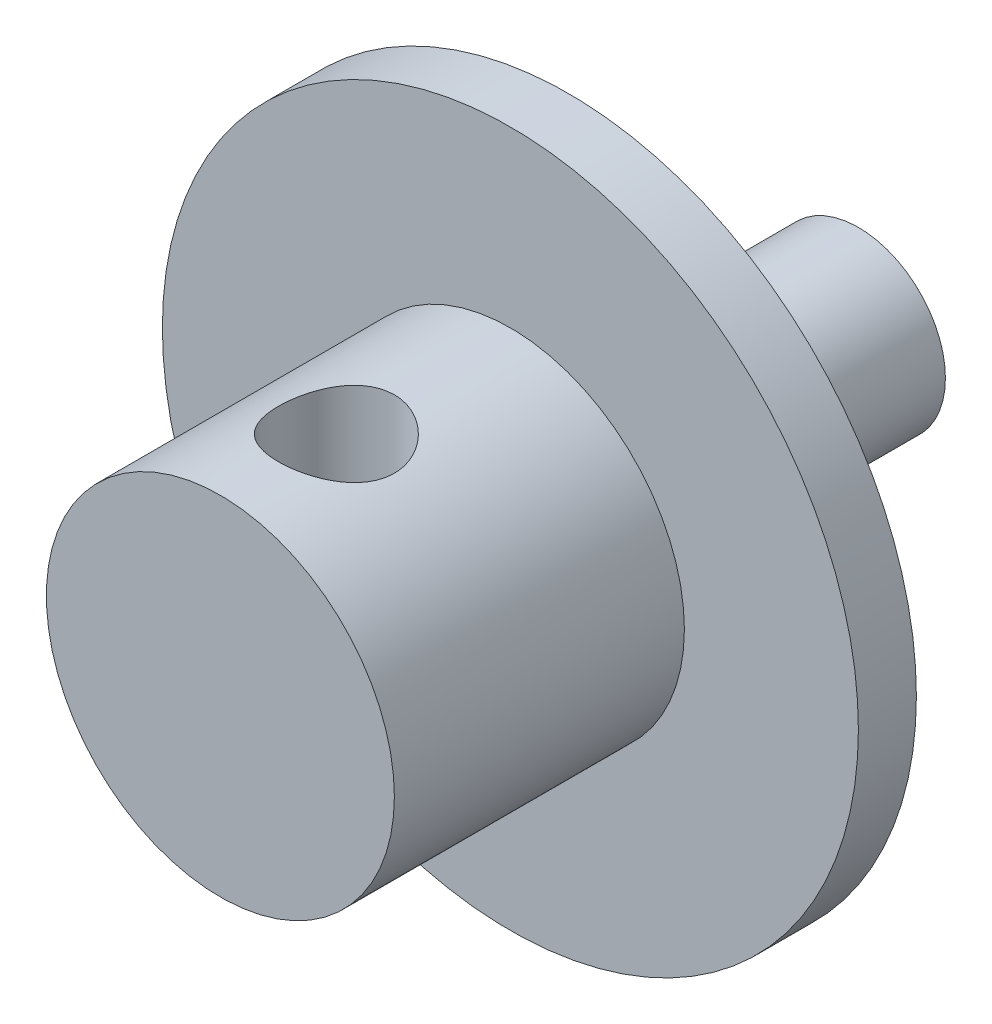
ISO-10303-21;
HEADER;
FILE_DESCRIPTION(('STEP AP214'),'2;1');
FILE_NAME('part.step','',(''),(''),'','','');
FILE_SCHEMA(('AUTOMOTIVE_DESIGN { 1 0 10303 214 1 1 1 1 }'));
ENDSEC;
DATA;
#1=APPLICATION_CONTEXT('core data for automotive mechanical design processes');
#2=APPLICATION_PROTOCOL_DEFINITION('international standard','automotive_design',2000,#1);
#3=PRODUCT_CONTEXT('',#1,'mechanical');
#4=PRODUCT('Part','Part','',(#3));
#5=PRODUCT_RELATED_PRODUCT_CATEGORY('part','',(#4));
#6=PRODUCT_DEFINITION_FORMATION('','',#4);
#7=PRODUCT_DEFINITION_CONTEXT('part definition',#1,'design');
#8=PRODUCT_DEFINITION('design','',#6,#7);
#9=PRODUCT_DEFINITION_SHAPE('','',#8);
#10=(LENGTH_UNIT() NAMED_UNIT(*) SI_UNIT(.MILLI.,.METRE.));
#11=(NAMED_UNIT(*) PLANE_ANGLE_UNIT() SI_UNIT($,.RADIAN.));
#12=(NAMED_UNIT(*) SI_UNIT($,.STERADIAN.) SOLID_ANGLE_UNIT());
#13=UNCERTAINTY_MEASURE_WITH_UNIT(LENGTH_MEASURE(1.E-05),#10,'distance_accuracy_value','');
#14=(GEOMETRIC_REPRESENTATION_CONTEXT(3) GLOBAL_UNCERTAINTY_ASSIGNED_CONTEXT((#13)) GLOBAL_UNIT_ASSIGNED_CONTEXT((#10,
#11,#12)) REPRESENTATION_CONTEXT('',''));
#15=CARTESIAN_POINT('',(0.,0.,0.));
#16=DIRECTION('',(0.,0.,1.));
#17=DIRECTION('',(1.,0.,0.));
#18=AXIS2_PLACEMENT_3D('',#15,#16,#17);
#19=CARTESIAN_POINT('',(0.,0.,11.));
#20=DIRECTION('',(0.,0.,-1.));
#21=DIRECTION('',(-1.,0.,0.));
#22=AXIS2_PLACEMENT_3D('',#19,#20,#21);
#23=CYLINDRICAL_SURFACE('',#22,3.);
#24=CARTESIAN_POINT('',(0.,0.,11.));
#25=DIRECTION('',(0.,0.,1.));
#26=DIRECTION('',(1.,0.,0.));
#27=AXIS2_PLACEMENT_3D('',#24,#25,#26);
#28=CIRCLE('',#27,3.);
#29=CARTESIAN_POINT('',(3.,0.,11.));
#30=VERTEX_POINT('',#29);
#31=EDGE_CURVE('E84',#30,#30,#28,.T.);
#32=ORIENTED_EDGE('',*,*,#31,.F.);
#33=EDGE_LOOP('',(#32));
#34=FACE_BOUND('',#33,.T.);
#35=CARTESIAN_POINT('',(0.,0.,6.));
#36=DIRECTION('',(0.,0.,1.));
#37=DIRECTION('',(1.,0.,0.));
#38=AXIS2_PLACEMENT_3D('',#35,#36,#37);
#39=CIRCLE('',#38,3.);
#40=CARTESIAN_POINT('',(3.,0.,6.));
#41=VERTEX_POINT('',#40);
#42=EDGE_CURVE('E88',#41,#41,#39,.T.);
#43=ORIENTED_EDGE('',*,*,#42,.T.);
#44=EDGE_LOOP('',(#43));
#45=FACE_BOUND('',#44,.T.);
#46=CARTESIAN_POINT('',(0.,-3.,8.));
#47=CARTESIAN_POINT('',(0.0545633628867247,-3.00000015300943,7.99999974626836));
#48=CARTESIAN_POINT('',(0.109125194538551,-2.99849769507545,8.00448026612722));
#49=CARTESIAN_POINT('',(0.216641760872974,-2.99265210203281,8.02222910881722));
#50=CARTESIAN_POINT('',(0.269596328118819,-2.98830867202153,8.03549834394892));
#51=CARTESIAN_POINT('',(0.372332789501778,-2.97725307906443,8.07031924338405));
#52=CARTESIAN_POINT('',(0.422119825886036,-2.97054487730853,8.09185706245927));
#53=CARTESIAN_POINT('',(0.517374936805326,-2.95544445717342,8.14254117283835));
#54=CARTESIAN_POINT('',(0.562842156958707,-2.94705190667778,8.1716889650026));
#55=CARTESIAN_POINT('',(0.649741675022268,-2.92914094443005,8.23782580485875));
#56=CARTESIAN_POINT('',(0.691003700298312,-2.91959556463785,8.27503123426049));
#57=CARTESIAN_POINT('',(0.766832692702086,-2.90060314783121,8.35576715470657));
#58=CARTESIAN_POINT('',(0.801398185489464,-2.89115613290549,8.39929903492851));
#59=CARTESIAN_POINT('',(0.86382494222786,-2.87313332477274,8.49298511519646));
#60=CARTESIAN_POINT('',(0.891464858221033,-2.86459039275688,8.54329373973212));
#61=CARTESIAN_POINT('',(0.937818873877723,-2.84975305418601,8.64817609445855));
#62=CARTESIAN_POINT('',(0.956535697386767,-2.84345796160746,8.70274851716274));
#63=CARTESIAN_POINT('',(0.983873461509165,-2.83411303269377,8.81267322149671));
#64=CARTESIAN_POINT('',(0.992813448271771,-2.83096095769611,8.86793720848906));
#65=CARTESIAN_POINT('',(1.00134112333448,-2.82795656629508,8.97926375415588));
#66=CARTESIAN_POINT('',(1.00093170160472,-2.8281032302273,9.03532606070919));
#67=CARTESIAN_POINT('',(0.991019903703421,-2.8315901500818,9.14393663044402));
#68=CARTESIAN_POINT('',(0.981933913166996,-2.83478415867533,9.19652840291902));
#69=CARTESIAN_POINT('',(0.955606162849418,-2.84376657724551,9.29939341960683));
#70=CARTESIAN_POINT('',(0.938363426591872,-2.84955529784108,9.34966638543507));
#71=CARTESIAN_POINT('',(0.895939058060212,-2.86317911131249,9.44741274959148));
#72=CARTESIAN_POINT('',(0.870634048707263,-2.87104565793117,9.49482802546953));
#73=CARTESIAN_POINT('',(0.81288910630314,-2.88792558575726,9.58487090827973));
#74=CARTESIAN_POINT('',(0.780447112364006,-2.89693929790464,9.62749712693338));
#75=CARTESIAN_POINT('',(0.707349332682238,-2.91567329167741,9.70909159816077));
#76=CARTESIAN_POINT('',(0.666353150076312,-2.92540589354843,9.74775269450907));
#77=CARTESIAN_POINT('',(0.578339569970065,-2.94406938387037,9.8177312666634));
#78=CARTESIAN_POINT('',(0.531321595660815,-2.95300019538067,9.8490480381645));
#79=CARTESIAN_POINT('',(0.431947613046269,-2.96917107937794,9.90369630023507));
#80=CARTESIAN_POINT('',(0.379543276416338,-2.97639350008039,9.92694549134073));
#81=CARTESIAN_POINT('',(0.271269083364509,-2.98820567144435,9.96420317395571));
#82=CARTESIAN_POINT('',(0.215400438154955,-2.99279633654879,9.97821487542344));
#83=CARTESIAN_POINT('',(0.104383829529305,-2.99867627071441,9.99605566602236));
#84=CARTESIAN_POINT('',(0.0493095998648466,-3.00010001833731,10.0002998091727));
#85=CARTESIAN_POINT('',(-0.0607750699602353,-2.99988902694825,9.99966732640153));
#86=CARTESIAN_POINT('',(-0.115785519319646,-2.99825480419352,9.99479224002013));
#87=CARTESIAN_POINT('',(-0.222519866304258,-2.99220024717114,9.97638809226403));
#88=CARTESIAN_POINT('',(-0.274292806834855,-2.98786198711228,9.96311379395048));
#89=CARTESIAN_POINT('',(-0.37485595857956,-2.97691846830034,9.9286065555333));
#90=CARTESIAN_POINT('',(-0.423645788508559,-2.97031292046541,9.90737260053232));
#91=CARTESIAN_POINT('',(-0.518288296393321,-2.95528931287427,9.8569295681591));
#92=CARTESIAN_POINT('',(-0.564029959217329,-2.94682814756305,9.8275254067164));
#93=CARTESIAN_POINT('',(-0.650064830135403,-2.92905253915743,9.76180584998695));
#94=CARTESIAN_POINT('',(-0.690356367794893,-2.91973783591888,9.72548834396984));
#95=CARTESIAN_POINT('',(-0.766252507807013,-2.90076847982472,9.64502124899174));
#96=CARTESIAN_POINT('',(-0.801560969248491,-2.89111761095156,9.60059077306675));
#97=CARTESIAN_POINT('',(-0.864257522320853,-2.87299973286981,9.5062284321955));
#98=CARTESIAN_POINT('',(-0.891645547920842,-2.8645327335312,9.4562965213898));
#99=CARTESIAN_POINT('',(-0.93759693042336,-2.84982391820308,9.35232698469341));
#100=CARTESIAN_POINT('',(-0.956178132197765,-2.84357760900632,9.29829792075722));
#101=CARTESIAN_POINT('',(-0.983894666792162,-2.83410832399133,9.18762134987585));
#102=CARTESIAN_POINT('',(-0.993034254961243,-2.83088398622698,9.13097503456694));
#103=CARTESIAN_POINT('',(-1.00127628247038,-2.82797858875071,9.01980290398679));
#104=CARTESIAN_POINT('',(-1.00087025731093,-2.82812400344299,8.96531765974826));
#105=CARTESIAN_POINT('',(-0.991242293454877,-2.8315126992356,8.85723492510025));
#106=CARTESIAN_POINT('',(-0.982020879458886,-2.83475579595884,8.80363738204709));
#107=CARTESIAN_POINT('',(-0.955371813126979,-2.84384524278944,8.69986433698733));
#108=CARTESIAN_POINT('',(-0.938103346014879,-2.84964098015514,8.64964317499277));
#109=CARTESIAN_POINT('',(-0.895979365760381,-2.86316398825434,8.55277259306447));
#110=CARTESIAN_POINT('',(-0.871122168553978,-2.87089168765297,8.50612396881274));
#111=CARTESIAN_POINT('',(-0.813260692583248,-2.8878282922406,8.41551633007631));
#112=CARTESIAN_POINT('',(-0.779948242764531,-2.89708711641604,8.3717634981014));
#113=CARTESIAN_POINT('',(-0.706642883135696,-2.91583356283786,8.29031018661601));
#114=CARTESIAN_POINT('',(-0.666648084451493,-2.92532124912518,8.25261142431198));
#115=CARTESIAN_POINT('',(-0.579241556920673,-2.94390030525393,8.18285558771076));
#116=CARTESIAN_POINT('',(-0.531601513499724,-2.95296181801216,8.15107565224898));
#117=CARTESIAN_POINT('',(-0.431357357406627,-2.96925991172653,8.09600957114937));
#118=CARTESIAN_POINT('',(-0.378754518132348,-2.9764969590794,8.07272125407796));
#119=CARTESIAN_POINT('',(-0.272493647200974,-2.98805515068532,8.03627836751132));
#120=CARTESIAN_POINT('',(-0.218987757676407,-2.9924921242252,8.02271753373662));
#121=CARTESIAN_POINT('',(-0.110320416010246,-2.99846407064225,8.00457971932287));
#122=CARTESIAN_POINT('',(-0.0551594255687453,-2.99999984531906,8.00000025650346));
#123=CARTESIAN_POINT('',(0.,-3.,8.));
#124=B_SPLINE_CURVE_WITH_KNOTS('',3,(#46,#47,#48,#49,#50,#51,#52,#53,#54,#55,#56,#57,#58,#59,
#60,#61,#62,#63,#64,#65,#66,#67,#68,#69,#70,#71,#72,#73,#74,#75,#76,#77,#78,#79,#80,#81,#82,#83,
#84,#85,#86,#87,#88,#89,#90,#91,#92,#93,#94,#95,#96,#97,#98,#99,#100,#101,#102,#103,#104,#105,
#106,#107,#108,#109,#110,#111,#112,#113,#114,#115,#116,#117,#118,#119,#120,#121,#122,#123),
.UNSPECIFIED.,.T.,.F.,(4,2,2,2,2,2,2,2,2,2,2,2,2,2,2,2,2,2,2,2,2,2,2,2,2,2,2,2,2,2,2,2,2,2,2,2,
2,2,4),(0.,0.163487106026011,0.326991185267521,0.490222672870274,0.653486377799101,
0.821846842827561,0.990244332875303,1.16348384823471,1.33667044692834,1.5040192574184,
1.67131633987486,1.83096826551281,1.99063930855482,2.15288171155131,2.31517102558207,
2.48593305811367,2.65671145966619,2.82918405650358,3.00159668877208,3.1665358317517,
3.33144713164177,3.49158157978214,3.65173645284104,3.81610399843737,3.98052180821891,
4.15241022880752,4.32430008234997,4.49584013824417,4.66730284700846,4.82995666056619,
4.99260079341186,5.15215587070228,5.31174638165788,5.47830066681615,5.64490211113589,
5.81799660824911,5.99104681142267,6.15636558363624,6.3216386602795),.UNSPECIFIED.);
#125=CARTESIAN_POINT('',(0.,-3.,8.));
#126=VERTEX_POINT('',#125);
#127=EDGE_CURVE('E53',#126,#126,#124,.T.);
#128=ORIENTED_EDGE('',*,*,#127,.F.);
#129=EDGE_LOOP('',(#128));
#130=FACE_BOUND('',#129,.T.);
#131=CARTESIAN_POINT('',(0.,3.,8.));
#132=CARTESIAN_POINT('',(-0.0545633628867221,3.00000015300943,7.99999974626836));
#133=CARTESIAN_POINT('',(-0.109125194538549,2.99849769507545,8.00448026612722));
#134=CARTESIAN_POINT('',(-0.216641760872971,2.99265210203281,8.02222910881722));
#135=CARTESIAN_POINT('',(-0.269596328118817,2.98830867202153,8.03549834394892));
#136=CARTESIAN_POINT('',(-0.372332789501775,2.97725307906443,8.07031924338405));
#137=CARTESIAN_POINT('',(-0.422119825886034,2.97054487730853,8.09185706245927));
#138=CARTESIAN_POINT('',(-0.517374936805324,2.95544445717342,8.14254117283835));
#139=CARTESIAN_POINT('',(-0.562842156958705,2.94705190667778,8.1716889650026));
#140=CARTESIAN_POINT('',(-0.649741675022266,2.92914094443005,8.23782580485875));
#141=CARTESIAN_POINT('',(-0.691003700298309,2.91959556463785,8.27503123426049));
#142=CARTESIAN_POINT('',(-0.766832692702084,2.90060314783122,8.35576715470657));
#143=CARTESIAN_POINT('',(-0.801398185489462,2.89115613290549,8.39929903492851));
#144=CARTESIAN_POINT('',(-0.863824942227858,2.87313332477274,8.49298511519646));
#145=CARTESIAN_POINT('',(-0.891464858221031,2.86459039275688,8.54329373973212));
#146=CARTESIAN_POINT('',(-0.937818873877721,2.84975305418601,8.64817609445855));
#147=CARTESIAN_POINT('',(-0.956535697386764,2.84345796160746,8.70274851716274));
#148=CARTESIAN_POINT('',(-0.983873461509163,2.83411303269377,8.81267322149671));
#149=CARTESIAN_POINT('',(-0.992813448271768,2.83096095769611,8.86793720848906));
#150=CARTESIAN_POINT('',(-1.00134112333448,2.82795656629508,8.97926375415588));
#151=CARTESIAN_POINT('',(-1.00093170160472,2.8281032302273,9.03532606070919));
#152=CARTESIAN_POINT('',(-0.991019903703418,2.8315901500818,9.14393663044402));
#153=CARTESIAN_POINT('',(-0.981933913166994,2.83478415867533,9.19652840291902));
#154=CARTESIAN_POINT('',(-0.955606162849416,2.84376657724551,9.29939341960683));
#155=CARTESIAN_POINT('',(-0.938363426591869,2.84955529784108,9.34966638543507));
#156=CARTESIAN_POINT('',(-0.895939058060209,2.86317911131249,9.44741274959148));
#157=CARTESIAN_POINT('',(-0.870634048707261,2.87104565793117,9.49482802546953));
#158=CARTESIAN_POINT('',(-0.812889106303137,2.88792558575726,9.58487090827973));
#159=CARTESIAN_POINT('',(-0.780447112364004,2.89693929790464,9.62749712693338));
#160=CARTESIAN_POINT('',(-0.707349332682236,2.91567329167741,9.70909159816077));
#161=CARTESIAN_POINT('',(-0.66635315007631,2.92540589354843,9.74775269450907));
#162=CARTESIAN_POINT('',(-0.578339569970062,2.94406938387037,9.8177312666634));
#163=CARTESIAN_POINT('',(-0.531321595660812,2.95300019538067,9.8490480381645));
#164=CARTESIAN_POINT('',(-0.431947613046266,2.96917107937794,9.90369630023507));
#165=CARTESIAN_POINT('',(-0.379543276416335,2.9763935000804,9.92694549134073));
#166=CARTESIAN_POINT('',(-0.271269083364506,2.98820567144435,9.96420317395571));
#167=CARTESIAN_POINT('',(-0.215400438154953,2.99279633654879,9.97821487542344));
#168=CARTESIAN_POINT('',(-0.104383829529302,2.99867627071441,9.99605566602236));
#169=CARTESIAN_POINT('',(-0.0493095998648439,3.00010001833731,10.0002998091727));
#170=CARTESIAN_POINT('',(0.060775069960238,2.99988902694825,9.99966732640153));
#171=CARTESIAN_POINT('',(0.115785519319649,2.99825480419352,9.99479224002013));
#172=CARTESIAN_POINT('',(0.222519866304261,2.99220024717114,9.97638809226403));
#173=CARTESIAN_POINT('',(0.274292806834858,2.98786198711228,9.96311379395048));
#174=CARTESIAN_POINT('',(0.374855958579563,2.97691846830034,9.9286065555333));
#175=CARTESIAN_POINT('',(0.423645788508561,2.97031292046541,9.90737260053232));
#176=CARTESIAN_POINT('',(0.518288296393323,2.95528931287427,9.8569295681591));
#177=CARTESIAN_POINT('',(0.564029959217331,2.94682814756305,9.8275254067164));
#178=CARTESIAN_POINT('',(0.650064830135405,2.92905253915743,9.76180584998695));
#179=CARTESIAN_POINT('',(0.690356367794895,2.91973783591888,9.72548834396984));
#180=CARTESIAN_POINT('',(0.766252507807015,2.90076847982472,9.64502124899174));
#181=CARTESIAN_POINT('',(0.801560969248494,2.89111761095155,9.60059077306675));
#182=CARTESIAN_POINT('',(0.864257522320856,2.87299973286981,9.5062284321955));
#183=CARTESIAN_POINT('',(0.891645547920845,2.8645327335312,9.4562965213898));
#184=CARTESIAN_POINT('',(0.937596930423362,2.84982391820308,9.35232698469341));
#185=CARTESIAN_POINT('',(0.956178132197768,2.84357760900632,9.29829792075722));
#186=CARTESIAN_POINT('',(0.983894666792164,2.83410832399133,9.18762134987585));
#187=CARTESIAN_POINT('',(0.993034254961246,2.83088398622698,9.13097503456694));
#188=CARTESIAN_POINT('',(1.00127628247038,2.82797858875071,9.01980290398679));
#189=CARTESIAN_POINT('',(1.00087025731093,2.82812400344299,8.96531765974826));
#190=CARTESIAN_POINT('',(0.991242293454879,2.8315126992356,8.85723492510025));
#191=CARTESIAN_POINT('',(0.982020879458888,2.83475579595884,8.80363738204709));
#192=CARTESIAN_POINT('',(0.955371813126982,2.84384524278943,8.69986433698733));
#193=CARTESIAN_POINT('',(0.938103346014881,2.84964098015514,8.64964317499277));
#194=CARTESIAN_POINT('',(0.895979365760383,2.86316398825434,8.55277259306447));
#195=CARTESIAN_POINT('',(0.871122168553981,2.87089168765297,8.50612396881274));
#196=CARTESIAN_POINT('',(0.813260692583251,2.8878282922406,8.41551633007631));
#197=CARTESIAN_POINT('',(0.779948242764534,2.89708711641604,8.3717634981014));
#198=CARTESIAN_POINT('',(0.706642883135699,2.91583356283786,8.29031018661601));
#199=CARTESIAN_POINT('',(0.666648084451496,2.92532124912518,8.25261142431198));
#200=CARTESIAN_POINT('',(0.579241556920676,2.94390030525393,8.18285558771076));
#201=CARTESIAN_POINT('',(0.531601513499726,2.95296181801216,8.15107565224898));
#202=CARTESIAN_POINT('',(0.43135735740663,2.96925991172652,8.09600957114937));
#203=CARTESIAN_POINT('',(0.378754518132351,2.9764969590794,8.07272125407796));
#204=CARTESIAN_POINT('',(0.272493647200976,2.98805515068532,8.03627836751132));
#205=CARTESIAN_POINT('',(0.21898775767641,2.9924921242252,8.02271753373662));
#206=CARTESIAN_POINT('',(0.110320416010249,2.99846407064225,8.00457971932287));
#207=CARTESIAN_POINT('',(0.0551594255687479,2.99999984531906,8.00000025650346));
#208=CARTESIAN_POINT('',(0.,3.,8.));
#209=B_SPLINE_CURVE_WITH_KNOTS('',3,(#131,#132,#133,#134,#135,#136,#137,#138,#139,#140,#141,
#142,#143,#144,#145,#146,#147,#148,#149,#150,#151,#152,#153,#154,#155,#156,#157,#158,#159,#160,
#161,#162,#163,#164,#165,#166,#167,#168,#169,#170,#171,#172,#173,#174,#175,#176,#177,#178,#179,
#180,#181,#182,#183,#184,#185,#186,#187,#188,#189,#190,#191,#192,#193,#194,#195,#196,#197,#198,
#199,#200,#201,#202,#203,#204,#205,#206,#207,#208),.UNSPECIFIED.,.T.,.F.,(4,2,2,2,2,2,2,2,2,2,2,
2,2,2,2,2,2,2,2,2,2,2,2,2,2,2,2,2,2,2,2,2,2,2,2,2,2,2,4),(0.,0.163487106026011,
0.326991185267521,0.490222672870274,0.653486377799101,0.821846842827561,0.990244332875304,
1.16348384823471,1.33667044692834,1.5040192574184,1.67131633987486,1.83096826551281,
1.99063930855482,2.15288171155131,2.31517102558207,2.48593305811367,2.65671145966618,
2.82918405650358,3.00159668877208,3.1665358317517,3.33144713164177,3.49158157978214,
3.65173645284104,3.81610399843737,3.98052180821891,4.15241022880752,4.32430008234997,
4.49584013824417,4.66730284700846,4.82995666056619,4.99260079341186,5.15215587070228,
5.31174638165788,5.47830066681615,5.64490211113589,5.81799660824911,5.99104681142267,
6.15636558363624,6.3216386602795),.UNSPECIFIED.);
#210=CARTESIAN_POINT('',(0.,3.,8.));
#211=VERTEX_POINT('',#210);
#212=EDGE_CURVE('E35',#211,#211,#209,.T.);
#213=ORIENTED_EDGE('',*,*,#212,.F.);
#214=EDGE_LOOP('',(#213));
#215=FACE_BOUND('',#214,.T.);
#216=ADVANCED_FACE('F31',(#34,#45,#130,#215),#23,.T.);
#217=CARTESIAN_POINT('',(0.,0.,5.));
#218=DIRECTION('',(0.,0.,-1.));
#219=DIRECTION('',(-1.,0.,0.));
#220=AXIS2_PLACEMENT_3D('',#217,#218,#219);
#221=CYLINDRICAL_SURFACE('',#220,1.5);
#222=CARTESIAN_POINT('',(0.,0.,5.));
#223=DIRECTION('',(0.,0.,1.));
#224=DIRECTION('',(1.,0.,0.));
#225=AXIS2_PLACEMENT_3D('',#222,#223,#224);
#226=CIRCLE('',#225,1.5);
#227=CARTESIAN_POINT('',(1.5,0.,5.));
#228=VERTEX_POINT('',#227);
#229=EDGE_CURVE('E10',#228,#228,#226,.T.);
#230=ORIENTED_EDGE('',*,*,#229,.F.);
#231=EDGE_LOOP('',(#230));
#232=FACE_BOUND('',#231,.T.);
#233=CARTESIAN_POINT('',(0.,0.,0.));
#234=DIRECTION('',(0.,0.,1.));
#235=DIRECTION('',(1.,0.,0.));
#236=AXIS2_PLACEMENT_3D('',#233,#234,#235);
#237=CIRCLE('',#236,1.5);
#238=CARTESIAN_POINT('',(1.5,0.,0.));
#239=VERTEX_POINT('',#238);
#240=EDGE_CURVE('E43',#239,#239,#237,.T.);
#241=ORIENTED_EDGE('',*,*,#240,.T.);
#242=EDGE_LOOP('',(#241));
#243=FACE_BOUND('',#242,.T.);
#244=ADVANCED_FACE('F33',(#232,#243),#221,.T.);
#245=CARTESIAN_POINT('',(0.,0.,0.));
#246=DIRECTION('',(0.,0.,1.));
#247=DIRECTION('',(1.,0.,0.));
#248=AXIS2_PLACEMENT_3D('',#245,#246,#247);
#249=PLANE('',#248);
#250=ORIENTED_EDGE('',*,*,#240,.F.);
#251=EDGE_LOOP('',(#250));
#252=FACE_BOUND('',#251,.T.);
#253=ADVANCED_FACE('F80',(#252),#249,.F.);
#254=CARTESIAN_POINT('',(0.,0.,6.));
#255=DIRECTION('',(0.,0.,-1.));
#256=DIRECTION('',(-1.,0.,0.));
#257=AXIS2_PLACEMENT_3D('',#254,#255,#256);
#258=CYLINDRICAL_SURFACE('',#257,6.);
#259=CARTESIAN_POINT('',(0.,0.,6.));
#260=DIRECTION('',(0.,0.,1.));
#261=DIRECTION('',(1.,0.,0.));
#262=AXIS2_PLACEMENT_3D('',#259,#260,#261);
#263=CIRCLE('',#262,6.);
#264=CARTESIAN_POINT('',(6.,0.,6.));
#265=VERTEX_POINT('',#264);
#266=EDGE_CURVE('E48',#265,#265,#263,.T.);
#267=ORIENTED_EDGE('',*,*,#266,.F.);
#268=EDGE_LOOP('',(#267));
#269=FACE_BOUND('',#268,.T.);
#270=CARTESIAN_POINT('',(0.,0.,5.));
#271=DIRECTION('',(0.,0.,1.));
#272=DIRECTION('',(1.,0.,0.));
#273=AXIS2_PLACEMENT_3D('',#270,#271,#272);
#274=CIRCLE('',#273,6.);
#275=CARTESIAN_POINT('',(6.,0.,5.));
#276=VERTEX_POINT('',#275);
#277=EDGE_CURVE('E51',#276,#276,#274,.T.);
#278=ORIENTED_EDGE('',*,*,#277,.T.);
#279=EDGE_LOOP('',(#278));
#280=FACE_BOUND('',#279,.T.);
#281=ADVANCED_FACE('F102',(#269,#280),#258,.T.);
#282=CARTESIAN_POINT('',(0.,0.,6.));
#283=DIRECTION('',(0.,0.,1.));
#284=DIRECTION('',(1.,0.,0.));
#285=AXIS2_PLACEMENT_3D('',#282,#283,#284);
#286=PLANE('',#285);
#287=ORIENTED_EDGE('',*,*,#42,.F.);
#288=EDGE_LOOP('',(#287));
#289=FACE_BOUND('',#288,.T.);
#290=ORIENTED_EDGE('',*,*,#266,.T.);
#291=EDGE_LOOP('',(#290));
#292=FACE_BOUND('',#291,.T.);
#293=ADVANCED_FACE('F72',(#289,#292),#286,.T.);
#294=CARTESIAN_POINT('',(0.,0.,5.));
#295=DIRECTION('',(0.,0.,1.));
#296=DIRECTION('',(1.,0.,0.));
#297=AXIS2_PLACEMENT_3D('',#294,#295,#296);
#298=PLANE('',#297);
#299=ORIENTED_EDGE('',*,*,#229,.T.);
#300=EDGE_LOOP('',(#299));
#301=FACE_BOUND('',#300,.T.);
#302=ORIENTED_EDGE('',*,*,#277,.F.);
#303=EDGE_LOOP('',(#302));
#304=FACE_BOUND('',#303,.T.);
#305=ADVANCED_FACE('F67',(#301,#304),#298,.F.);
#306=CARTESIAN_POINT('',(0.,0.,11.));
#307=DIRECTION('',(0.,0.,1.));
#308=DIRECTION('',(1.,0.,0.));
#309=AXIS2_PLACEMENT_3D('',#306,#307,#308);
#310=PLANE('',#309);
#311=ORIENTED_EDGE('',*,*,#31,.T.);
#312=EDGE_LOOP('',(#311));
#313=FACE_BOUND('',#312,.T.);
#314=ADVANCED_FACE('F63',(#313),#310,.T.);
#315=CARTESIAN_POINT('',(0.,5.,9.));
#316=DIRECTION('',(0.,-1.,0.));
#317=DIRECTION('',(0.,0.,-1.));
#318=AXIS2_PLACEMENT_3D('',#315,#316,#317);
#319=CYLINDRICAL_SURFACE('',#318,1.);
#320=ORIENTED_EDGE('',*,*,#127,.T.);
#321=EDGE_LOOP('',(#320));
#322=FACE_BOUND('',#321,.T.);
#323=ORIENTED_EDGE('',*,*,#212,.T.);
#324=EDGE_LOOP('',(#323));
#325=FACE_BOUND('',#324,.T.);
#326=ADVANCED_FACE('F60',(#322,#325),#319,.F.);
#327=CLOSED_SHELL('',(#216,#244,#253,#281,#293,#305,#314,#326));
#328=MANIFOLD_SOLID_BREP('B2',#327);
#329=ADVANCED_BREP_SHAPE_REPRESENTATION('',(#18,#328),#14);
#330=SHAPE_DEFINITION_REPRESENTATION(#9,#329);
ENDSEC;
END-ISO-10303-21;
